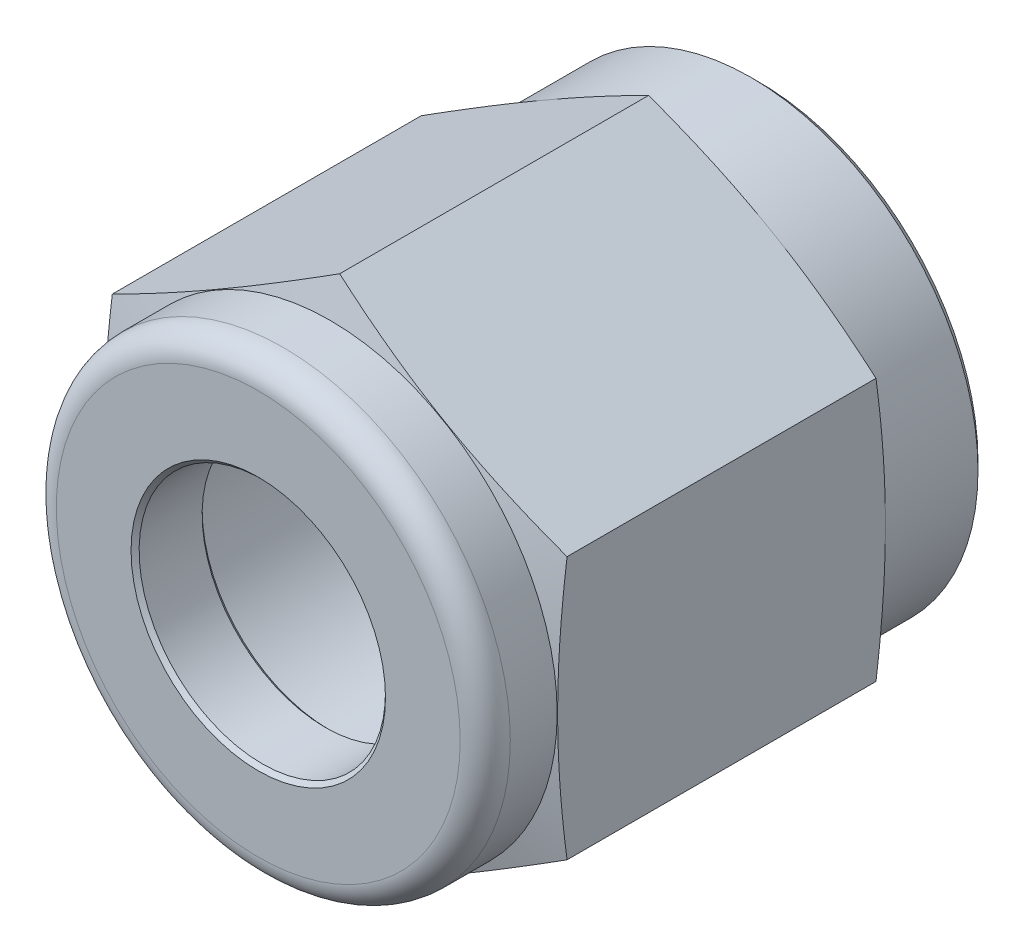
ISO-10303-21;
HEADER;
FILE_DESCRIPTION(('STEP AP214'),'2;1');
FILE_NAME('part.step','',(''),(''),'','','');
FILE_SCHEMA(('AUTOMOTIVE_DESIGN { 1 0 10303 214 1 1 1 1 }'));
ENDSEC;
DATA;
#1=APPLICATION_CONTEXT('core data for automotive mechanical design processes');
#2=APPLICATION_PROTOCOL_DEFINITION('international standard','automotive_design',2000,#1);
#3=PRODUCT_CONTEXT('',#1,'mechanical');
#4=PRODUCT('Part','Part','',(#3));
#5=PRODUCT_RELATED_PRODUCT_CATEGORY('part','',(#4));
#6=PRODUCT_DEFINITION_FORMATION('','',#4);
#7=PRODUCT_DEFINITION_CONTEXT('part definition',#1,'design');
#8=PRODUCT_DEFINITION('design','',#6,#7);
#9=PRODUCT_DEFINITION_SHAPE('','',#8);
#10=(LENGTH_UNIT() NAMED_UNIT(*) SI_UNIT(.MILLI.,.METRE.));
#11=(NAMED_UNIT(*) PLANE_ANGLE_UNIT() SI_UNIT($,.RADIAN.));
#12=(NAMED_UNIT(*) SI_UNIT($,.STERADIAN.) SOLID_ANGLE_UNIT());
#13=UNCERTAINTY_MEASURE_WITH_UNIT(LENGTH_MEASURE(1.E-05),#10,'distance_accuracy_value','');
#14=(GEOMETRIC_REPRESENTATION_CONTEXT(3) GLOBAL_UNCERTAINTY_ASSIGNED_CONTEXT((#13)) GLOBAL_UNIT_ASSIGNED_CONTEXT((#10,
#11,#12)) REPRESENTATION_CONTEXT('',''));
#15=CARTESIAN_POINT('',(0.,0.,0.));
#16=DIRECTION('',(0.,0.,1.));
#17=DIRECTION('',(1.,0.,0.));
#18=AXIS2_PLACEMENT_3D('',#15,#16,#17);
#19=CARTESIAN_POINT('',(0.,8.25622431946549,0.));
#20=DIRECTION('',(0.,0.,1.));
#21=DIRECTION('',(1.,0.,0.));
#22=AXIS2_PLACEMENT_3D('',#19,#20,#21);
#23=PLANE('',#22);
#24=CARTESIAN_POINT('',(0.,0.,0.));
#25=DIRECTION('',(0.,0.,1.));
#26=DIRECTION('',(1.,0.,0.));
#27=AXIS2_PLACEMENT_3D('',#24,#25,#26);
#28=CIRCLE('',#27,6.88339999999999);
#29=CARTESIAN_POINT('',(6.88339999999999,0.,0.));
#30=VERTEX_POINT('',#29);
#31=EDGE_CURVE('E266',#30,#30,#28,.F.);
#32=ORIENTED_EDGE('',*,*,#31,.T.);
#33=EDGE_LOOP('',(#32));
#34=FACE_BOUND('',#33,.T.);
#35=CARTESIAN_POINT('',(0.,0.,0.));
#36=DIRECTION('',(0.,0.,-1.));
#37=DIRECTION('',(0.,1.,0.));
#38=AXIS2_PLACEMENT_3D('',#35,#36,#37);
#39=CIRCLE('',#38,4.78291637771435);
#40=CARTESIAN_POINT('',(0.,4.78291637771435,0.));
#41=VERTEX_POINT('',#40);
#42=EDGE_CURVE('E235',#41,#41,#39,.T.);
#43=ORIENTED_EDGE('',*,*,#42,.F.);
#44=EDGE_LOOP('',(#43));
#45=FACE_BOUND('',#44,.T.);
#46=ADVANCED_FACE('F34',(#34,#45),#23,.F.);
#47=CARTESIAN_POINT('',(0.,0.,0.));
#48=DIRECTION('',(0.,0.,-1.));
#49=DIRECTION('',(0.,1.,0.));
#50=AXIS2_PLACEMENT_3D('',#47,#48,#49);
#51=CYLINDRICAL_SURFACE('',#50,7.1374);
#52=CARTESIAN_POINT('',(0.,0.,0.254000000000007));
#53=DIRECTION('',(0.,0.,1.));
#54=DIRECTION('',(0.,-1.,0.));
#55=AXIS2_PLACEMENT_3D('',#52,#53,#54);
#56=CIRCLE('',#55,7.1374);
#57=CARTESIAN_POINT('',(0.,-7.1374,0.254000000000006));
#58=VERTEX_POINT('',#57);
#59=EDGE_CURVE('E270',#58,#58,#56,.T.);
#60=ORIENTED_EDGE('',*,*,#59,.T.);
#61=EDGE_LOOP('',(#60));
#62=FACE_BOUND('',#61,.T.);
#63=CARTESIAN_POINT('',(0.,0.,3.175));
#64=DIRECTION('',(0.,0.,-1.));
#65=DIRECTION('',(0.,1.,0.));
#66=AXIS2_PLACEMENT_3D('',#63,#64,#65);
#67=CIRCLE('',#66,7.1374);
#68=CARTESIAN_POINT('',(0.,7.1374,3.175));
#69=VERTEX_POINT('',#68);
#70=EDGE_CURVE('E223',#69,#69,#67,.T.);
#71=ORIENTED_EDGE('',*,*,#70,.T.);
#72=EDGE_LOOP('',(#71));
#73=FACE_BOUND('',#72,.T.);
#74=ADVANCED_FACE('F134',(#62,#73),#51,.T.);
#75=CARTESIAN_POINT('',(0.,0.,3.47478807287307));
#76=DIRECTION('',(0.,0.,1.));
#77=DIRECTION('',(0.,-1.,0.));
#78=AXIS2_PLACEMENT_3D('',#75,#76,#77);
#79=CONICAL_SURFACE('',#78,8.25622431946549,1.30899693899575);
#80=ORIENTED_EDGE('',*,*,#70,.F.);
#81=EDGE_LOOP('',(#80));
#82=FACE_BOUND('',#81,.T.);
#83=CARTESIAN_POINT('',(7.1501,-10.9138828398678,4.75860151542387));
#84=CARTESIAN_POINT('',(7.1501,-10.5895769453141,4.68593353797852));
#85=CARTESIAN_POINT('',(7.1501,-10.2650680273871,4.61415538239005));
#86=CARTESIAN_POINT('',(7.1501,-9.61554445132473,4.47285900938083));
#87=CARTESIAN_POINT('',(7.1501,-9.29052977193818,4.40334088976508));
#88=CARTESIAN_POINT('',(7.1501,-8.63960294263009,4.26698420272897));
#89=CARTESIAN_POINT('',(7.1501,-8.31369022433024,4.20014833891397));
#90=CARTESIAN_POINT('',(7.1501,-7.66118595771361,4.06987862293135));
#91=CARTESIAN_POINT('',(7.1501,-7.33459441516394,4.00644474198301));
#92=CARTESIAN_POINT('',(7.1501,-6.68322136510452,3.88427824027479));
#93=CARTESIAN_POINT('',(7.1501,-6.3584461559822,3.82551220270828));
#94=CARTESIAN_POINT('',(7.1501,-5.70800949079891,3.71311782777684));
#95=CARTESIAN_POINT('',(7.1501,-5.38234805443124,3.65948937719041));
#96=CARTESIAN_POINT('',(7.1501,-4.73007647747673,3.55857904077149));
#97=CARTESIAN_POINT('',(7.1501,-4.40346646054479,3.51129636258905));
#98=CARTESIAN_POINT('',(7.1501,-3.74920730598459,3.42447209387384));
#99=CARTESIAN_POINT('',(7.1501,-3.42155816742004,3.38493051031814));
#100=CARTESIAN_POINT('',(7.1501,-2.76152687678763,3.31470950062921));
#101=CARTESIAN_POINT('',(7.1501,-2.42913328445532,3.28413600874202));
#102=CARTESIAN_POINT('',(7.1501,-1.76351186555912,3.23396118681777));
#103=CARTESIAN_POINT('',(7.1501,-1.43028405830245,3.21435960516025));
#104=CARTESIAN_POINT('',(7.1501,-0.763477429194141,3.18727191792475));
#105=CARTESIAN_POINT('',(7.1501,-0.429898834629788,3.17978032997945));
#106=CARTESIAN_POINT('',(7.1501,0.237304404669708,3.17737307413878));
#107=CARTESIAN_POINT('',(7.1501,0.570929049369216,3.1824573965662));
#108=CARTESIAN_POINT('',(7.1501,1.23897011925806,3.20491601919626));
#109=CARTESIAN_POINT('',(7.1501,1.57338501416503,3.22233492739003));
#110=CARTESIAN_POINT('',(7.1501,2.24142747986446,3.26846906294717));
#111=CARTESIAN_POINT('',(7.1501,2.57505503309474,3.29718453993661));
#112=CARTESIAN_POINT('',(7.1501,3.24152020478241,3.36446292134966));
#113=CARTESIAN_POINT('',(7.1501,3.57435716585659,3.40303223824729));
#114=CARTESIAN_POINT('',(7.1501,4.23896018219755,3.48841538968918));
#115=CARTESIAN_POINT('',(7.1501,4.5707262341084,3.53522925004388));
#116=CARTESIAN_POINT('',(7.1501,5.21100647270475,3.63223991881821));
#117=CARTESIAN_POINT('',(7.15009999999999,5.51958762732812,3.68199919010589));
#118=CARTESIAN_POINT('',(7.15009999999999,6.13593768218003,3.78633917810774));
#119=CARTESIAN_POINT('',(7.15009999999999,6.44370656011541,3.840920025763));
#120=CARTESIAN_POINT('',(7.15009999999999,7.05854436625168,3.95402195375594));
#121=CARTESIAN_POINT('',(7.15009999999999,7.36561322948537,4.0125433855596));
#122=CARTESIAN_POINT('',(7.15009999999999,7.97912096047287,4.13280787737556));
#123=CARTESIAN_POINT('',(7.15009999999999,8.28555982003552,4.19455097900331));
#124=CARTESIAN_POINT('',(7.15009999999999,9.20420130280969,4.38373831827979));
#125=CARTESIAN_POINT('',(7.15009999999999,9.8155932174319,4.51511507330491));
#126=CARTESIAN_POINT('',(7.15009999999999,11.0367521079976,4.78497858913828));
#127=CARTESIAN_POINT('',(7.15009999999999,11.6465191763972,4.923464935903));
#128=CARTESIAN_POINT('',(7.15009999999999,12.8589027680631,5.20406216254));
#129=CARTESIAN_POINT('',(7.15009999999999,13.4615306645536,5.3461240373558));
#130=CARTESIAN_POINT('',(7.15009999999999,14.6659456190864,5.63380550214537));
#131=CARTESIAN_POINT('',(7.15009999999999,15.2677326616641,5.77942515666527));
#132=CARTESIAN_POINT('',(7.15009999999999,16.4699234495495,6.07311302859643));
#133=CARTESIAN_POINT('',(7.15009999999999,17.0703279858856,6.22117801444107));
#134=CARTESIAN_POINT('',(7.15009999999999,18.2706138615976,6.51933121206419));
#135=CARTESIAN_POINT('',(7.15009999999999,18.8704952175481,6.66941935707092));
#136=CARTESIAN_POINT('',(7.15009999999999,19.4701941525164,6.82022419671362));
#137=B_SPLINE_CURVE_WITH_KNOTS('',3,(#83,#84,#85,#86,#87,#88,#89,#90,#91,#92,#93,#94,#95,#96,
#97,#98,#99,#100,#101,#102,#103,#104,#105,#106,#107,#108,#109,#110,#111,#112,#113,#114,#115,
#116,#117,#118,#119,#120,#121,#122,#123,#124,#125,#126,#127,#128,#129,#130,#131,#132,#133,#134,
#135,#136),.UNSPECIFIED.,.F.,.F.,(4,2,2,2,2,2,2,2,2,2,2,2,2,2,2,2,2,2,2,2,2,2,2,2,2,2,4),(0.,
0.997046960858289,1.99413701250312,2.9922080643413,3.99027067118493,4.98038490126997,
5.97047730631967,6.96044597056545,7.95041552706989,8.9516470921889,9.95285569497361,
10.9536109092371,11.9543653534154,12.9587576300209,13.9631721024439,14.9682418788671,
15.9733148018248,16.9109716545956,17.8486539794465,18.7864200485021,19.7241982340131,
21.6001685185764,23.4760296753264,25.3334528568964,27.1909097613661,29.0460823073238,
30.9011937748789),.UNSPECIFIED.);
#138=CARTESIAN_POINT('',(7.1501,-4.12811215973275,3.47478807287307));
#139=VERTEX_POINT('',#138);
#140=CARTESIAN_POINT('',(7.1501,4.12811215973275,3.47478807287307));
#141=VERTEX_POINT('',#140);
#142=EDGE_CURVE('E106',#139,#141,#137,.T.);
#143=ORIENTED_EDGE('',*,*,#142,.F.);
#144=CARTESIAN_POINT('',(-0.000199999999988828,-8.25633978951932,3.47481901362982));
#145=CARTESIAN_POINT('',(0.296742266660478,-8.08490009192912,3.42886257681858));
#146=CARTESIAN_POINT('',(0.594222923002725,-7.91314955491122,3.38714171766773));
#147=CARTESIAN_POINT('',(1.19023480972998,-7.56904193166902,3.31384208241379));
#148=CARTESIAN_POINT('',(1.48876641720988,-7.39668462772889,3.2822674258099));
#149=CARTESIAN_POINT('',(2.08507021110049,-7.05240847180735,3.23110350009016));
#150=CARTESIAN_POINT('',(2.38283836532122,-6.88049194781191,3.21145321592267));
#151=CARTESIAN_POINT('',(2.97875440278981,-6.536439663165,3.1851041961545));
#152=CARTESIAN_POINT('',(3.27690220139491,-6.36430395138206,3.17840295474387));
#153=CARTESIAN_POINT('',(3.8731977986051,-6.02003252781616,3.17840295474387));
#154=CARTESIAN_POINT('',(4.17134559721019,-5.84789681603322,3.1851041961545));
#155=CARTESIAN_POINT('',(4.76726163467879,-5.50384453138631,3.21145321592267));
#156=CARTESIAN_POINT('',(5.06502978889951,-5.33192800739088,3.23110350009016));
#157=CARTESIAN_POINT('',(5.66133358279013,-4.98765185146934,3.2822674258099));
#158=CARTESIAN_POINT('',(5.95986519027003,-4.8152945475292,3.31384208241379));
#159=CARTESIAN_POINT('',(6.55587707699728,-4.471186924287,3.38714171766773));
#160=CARTESIAN_POINT('',(6.85335773333953,-4.2994363872691,3.42886257681858));
#161=CARTESIAN_POINT('',(7.1503,-4.1279966896789,3.47481901362982));
#162=B_SPLINE_CURVE_WITH_KNOTS('',3,(#144,#145,#146,#147,#148,#149,#150,#151,#152,#153,#154,
#155,#156,#157,#158,#159,#160,#161),.UNSPECIFIED.,.F.,.F.,(4,2,2,2,2,2,2,2,4),(0.,
1.0378908111893,2.07620248958682,3.10915548710712,4.14190857462195,5.17466166213679,
6.20761465965709,7.24592633805461,8.28381714924391),.UNSPECIFIED.);
#163=CARTESIAN_POINT('',(0.,-8.25622431946549,3.47478807287307));
#164=VERTEX_POINT('',#163);
#165=EDGE_CURVE('E145',#164,#139,#162,.T.);
#166=ORIENTED_EDGE('',*,*,#165,.F.);
#167=CARTESIAN_POINT('',(-7.1503,-4.1279966896789,3.47481901362982));
#168=CARTESIAN_POINT('',(-6.85335773333953,-4.2994363872691,3.42886257681858));
#169=CARTESIAN_POINT('',(-6.55587707699728,-4.471186924287,3.38714171766773));
#170=CARTESIAN_POINT('',(-5.95986519027002,-4.8152945475292,3.31384208241379));
#171=CARTESIAN_POINT('',(-5.66133358279012,-4.98765185146934,3.2822674258099));
#172=CARTESIAN_POINT('',(-5.06502978889951,-5.33192800739088,3.23110350009016));
#173=CARTESIAN_POINT('',(-4.76726163467878,-5.50384453138631,3.21145321592267));
#174=CARTESIAN_POINT('',(-4.17134559721019,-5.84789681603322,3.1851041961545));
#175=CARTESIAN_POINT('',(-3.87319779860509,-6.02003252781616,3.17840295474387));
#176=CARTESIAN_POINT('',(-3.2769022013949,-6.36430395138206,3.17840295474387));
#177=CARTESIAN_POINT('',(-2.9787544027898,-6.536439663165,3.1851041961545));
#178=CARTESIAN_POINT('',(-2.3828383653212,-6.88049194781191,3.21145321592267));
#179=CARTESIAN_POINT('',(-2.08507021110048,-7.05240847180735,3.23110350009016));
#180=CARTESIAN_POINT('',(-1.48876641720987,-7.39668462772889,3.2822674258099));
#181=CARTESIAN_POINT('',(-1.19023480972996,-7.56904193166902,3.31384208241379));
#182=CARTESIAN_POINT('',(-0.594222923002706,-7.91314955491122,3.38714171766773));
#183=CARTESIAN_POINT('',(-0.296742266660458,-8.08490009192912,3.42886257681858));
#184=CARTESIAN_POINT('',(0.000200000000009483,-8.25633978951932,3.47481901362982));
#185=B_SPLINE_CURVE_WITH_KNOTS('',3,(#167,#168,#169,#170,#171,#172,#173,#174,#175,#176,#177,
#178,#179,#180,#181,#182,#183,#184),.UNSPECIFIED.,.F.,.F.,(4,2,2,2,2,2,2,2,4),(0.,
1.0378908111893,2.07620248958683,3.10915548710713,4.14190857462196,5.1746616621368,
6.2076146596571,7.24592633805462,8.28381714924392),.UNSPECIFIED.);
#186=CARTESIAN_POINT('',(-7.15010000000001,-4.12811215973273,3.47478807287307));
#187=VERTEX_POINT('',#186);
#188=EDGE_CURVE('E153',#187,#164,#185,.T.);
#189=ORIENTED_EDGE('',*,*,#188,.F.);
#190=CARTESIAN_POINT('',(-7.15009999999999,-10.9138828398678,4.75860151542387));
#191=CARTESIAN_POINT('',(-7.15009999999999,-10.5895769453141,4.68593353797852));
#192=CARTESIAN_POINT('',(-7.15009999999999,-10.2650680273871,4.61415538239005));
#193=CARTESIAN_POINT('',(-7.15009999999999,-9.61554445132474,4.47285900938083));
#194=CARTESIAN_POINT('',(-7.15009999999999,-9.29052977193818,4.40334088976508));
#195=CARTESIAN_POINT('',(-7.15009999999999,-8.63960294263009,4.26698420272897));
#196=CARTESIAN_POINT('',(-7.15009999999999,-8.31369022433025,4.20014833891397));
#197=CARTESIAN_POINT('',(-7.15009999999999,-7.66118595771361,4.06987862293135));
#198=CARTESIAN_POINT('',(-7.15009999999999,-7.33459441516395,4.00644474198301));
#199=CARTESIAN_POINT('',(-7.15009999999999,-6.68322136510452,3.88427824027479));
#200=CARTESIAN_POINT('',(-7.15009999999999,-6.3584461559822,3.82551220270828));
#201=CARTESIAN_POINT('',(-7.15009999999999,-5.70800949079891,3.71311782777684));
#202=CARTESIAN_POINT('',(-7.15009999999999,-5.38234805443124,3.65948937719041));
#203=CARTESIAN_POINT('',(-7.15009999999999,-4.73007647747673,3.55857904077149));
#204=CARTESIAN_POINT('',(-7.1501,-4.40346646054479,3.51129636258905));
#205=CARTESIAN_POINT('',(-7.1501,-3.7492073059846,3.42447209387384));
#206=CARTESIAN_POINT('',(-7.1501,-3.42155816742005,3.38493051031814));
#207=CARTESIAN_POINT('',(-7.1501,-2.76152687678764,3.31470950062921));
#208=CARTESIAN_POINT('',(-7.1501,-2.42913328445533,3.28413600874202));
#209=CARTESIAN_POINT('',(-7.1501,-1.76351186555912,3.23396118681777));
#210=CARTESIAN_POINT('',(-7.1501,-1.43028405830246,3.21435960516025));
#211=CARTESIAN_POINT('',(-7.1501,-0.763477429194147,3.18727191792475));
#212=CARTESIAN_POINT('',(-7.1501,-0.429898834629794,3.17978032997945));
#213=CARTESIAN_POINT('',(-7.1501,0.237304404669702,3.17737307413878));
#214=CARTESIAN_POINT('',(-7.1501,0.57092904936921,3.1824573965662));
#215=CARTESIAN_POINT('',(-7.1501,1.23897011925806,3.20491601919626));
#216=CARTESIAN_POINT('',(-7.1501,1.57338501416502,3.22233492739003));
#217=CARTESIAN_POINT('',(-7.1501,2.24142747986446,3.26846906294717));
#218=CARTESIAN_POINT('',(-7.1501,2.57505503309474,3.29718453993661));
#219=CARTESIAN_POINT('',(-7.1501,3.2415202047824,3.36446292134967));
#220=CARTESIAN_POINT('',(-7.1501,3.57435716585659,3.40303223824729));
#221=CARTESIAN_POINT('',(-7.1501,4.23896018219754,3.48841538968918));
#222=CARTESIAN_POINT('',(-7.1501,4.5707262341084,3.53522925004388));
#223=CARTESIAN_POINT('',(-7.1501,5.21100647270474,3.63223991881821));
#224=CARTESIAN_POINT('',(-7.1501,5.51958762732811,3.68199919010589));
#225=CARTESIAN_POINT('',(-7.1501,6.13593768218002,3.78633917810774));
#226=CARTESIAN_POINT('',(-7.15010000000001,6.4437065601154,3.840920025763));
#227=CARTESIAN_POINT('',(-7.15010000000001,7.05854436625167,3.95402195375594));
#228=CARTESIAN_POINT('',(-7.15010000000001,7.36561322948536,4.0125433855596));
#229=CARTESIAN_POINT('',(-7.15010000000001,7.97912096047286,4.13280787737556));
#230=CARTESIAN_POINT('',(-7.15010000000001,8.28555982003552,4.19455097900331));
#231=CARTESIAN_POINT('',(-7.15010000000001,9.20420130280969,4.38373831827979));
#232=CARTESIAN_POINT('',(-7.15010000000001,9.81559321743189,4.51511507330491));
#233=CARTESIAN_POINT('',(-7.15010000000001,11.0367521079976,4.78497858913828));
#234=CARTESIAN_POINT('',(-7.15010000000001,11.6465191763972,4.923464935903));
#235=CARTESIAN_POINT('',(-7.15010000000001,12.8589027680631,5.20406216254));
#236=CARTESIAN_POINT('',(-7.15010000000001,13.4615306645536,5.3461240373558));
#237=CARTESIAN_POINT('',(-7.15010000000001,14.6659456190864,5.63380550214537));
#238=CARTESIAN_POINT('',(-7.15010000000001,15.267732661664,5.77942515666527));
#239=CARTESIAN_POINT('',(-7.15010000000001,16.4699234495495,6.07311302859643));
#240=CARTESIAN_POINT('',(-7.15010000000001,17.0703279858856,6.22117801444107));
#241=CARTESIAN_POINT('',(-7.15010000000002,18.2706138615976,6.51933121206419));
#242=CARTESIAN_POINT('',(-7.15010000000002,18.8704952175481,6.66941935707092));
#243=CARTESIAN_POINT('',(-7.15010000000002,19.4701941525164,6.82022419671361));
#244=B_SPLINE_CURVE_WITH_KNOTS('',3,(#190,#191,#192,#193,#194,#195,#196,#197,#198,#199,#200,
#201,#202,#203,#204,#205,#206,#207,#208,#209,#210,#211,#212,#213,#214,#215,#216,#217,#218,#219,
#220,#221,#222,#223,#224,#225,#226,#227,#228,#229,#230,#231,#232,#233,#234,#235,#236,#237,#238,
#239,#240,#241,#242,#243),.UNSPECIFIED.,.F.,.F.,(4,2,2,2,2,2,2,2,2,2,2,2,2,2,2,2,2,2,2,2,2,2,2,
2,2,2,4),(0.,0.997046960858289,1.99413701250312,2.9922080643413,3.99027067118493,
4.98038490126997,5.97047730631967,6.96044597056545,7.95041552706989,8.9516470921889,
9.95285569497361,10.9536109092371,11.9543653534154,12.9587576300209,13.9631721024439,
14.9682418788671,15.9733148018248,16.9109716545956,17.8486539794465,18.7864200485021,
19.7241982340131,21.6001685185764,23.4760296753264,25.3334528568964,27.1909097613661,
29.0460823073238,30.9011937748789),.UNSPECIFIED.);
#245=CARTESIAN_POINT('',(-7.1501,4.12811215973274,3.47478807287307));
#246=VERTEX_POINT('',#245);
#247=EDGE_CURVE('E88',#246,#187,#244,.F.);
#248=ORIENTED_EDGE('',*,*,#247,.F.);
#249=CARTESIAN_POINT('',(0.000200000000000074,8.25633978951933,3.47481901362982));
#250=CARTESIAN_POINT('',(-0.296742266660467,8.08490009192913,3.42886257681859));
#251=CARTESIAN_POINT('',(-0.594222923002715,7.91314955491122,3.38714171766774));
#252=CARTESIAN_POINT('',(-1.19023480972997,7.56904193166902,3.31384208241379));
#253=CARTESIAN_POINT('',(-1.48876641720987,7.39668462772889,3.2822674258099));
#254=CARTESIAN_POINT('',(-2.08507021110049,7.05240847180735,3.23110350009017));
#255=CARTESIAN_POINT('',(-2.38283836532121,6.88049194781192,3.21145321592267));
#256=CARTESIAN_POINT('',(-2.97875440278981,6.53643966316501,3.1851041961545));
#257=CARTESIAN_POINT('',(-3.2769022013949,6.36430395138206,3.17840295474388));
#258=CARTESIAN_POINT('',(-3.8731977986051,6.02003252781617,3.17840295474388));
#259=CARTESIAN_POINT('',(-4.17134559721019,5.84789681603322,3.1851041961545));
#260=CARTESIAN_POINT('',(-4.76726163467879,5.50384453138631,3.21145321592267));
#261=CARTESIAN_POINT('',(-5.06502978889952,5.33192800739088,3.23110350009017));
#262=CARTESIAN_POINT('',(-5.66133358279013,4.98765185146934,3.2822674258099));
#263=CARTESIAN_POINT('',(-5.95986519027003,4.81529454752921,3.31384208241379));
#264=CARTESIAN_POINT('',(-6.55587707699729,4.47118692428701,3.38714171766774));
#265=CARTESIAN_POINT('',(-6.85335773333953,4.2994363872691,3.42886257681859));
#266=CARTESIAN_POINT('',(-7.1503,4.12799668967891,3.47481901362982));
#267=B_SPLINE_CURVE_WITH_KNOTS('',3,(#249,#250,#251,#252,#253,#254,#255,#256,#257,#258,#259,
#260,#261,#262,#263,#264,#265,#266),.UNSPECIFIED.,.F.,.F.,(4,2,2,2,2,2,2,2,4),(0.,
1.0378908111893,2.07620248958682,3.10915548710713,4.14190857462196,5.1746616621368,
6.2076146596571,7.24592633805462,8.28381714924392),.UNSPECIFIED.);
#268=CARTESIAN_POINT('',(0.,8.25622431946549,3.47478807287307));
#269=VERTEX_POINT('',#268);
#270=EDGE_CURVE('E85',#269,#246,#267,.T.);
#271=ORIENTED_EDGE('',*,*,#270,.F.);
#272=CARTESIAN_POINT('',(7.1503,4.12799668967892,3.47481901362982));
#273=CARTESIAN_POINT('',(6.85335773333953,4.29943638726911,3.42886257681859));
#274=CARTESIAN_POINT('',(6.55587707699728,4.47118692428702,3.38714171766774));
#275=CARTESIAN_POINT('',(5.95986519027002,4.81529454752921,3.31384208241379));
#276=CARTESIAN_POINT('',(5.66133358279012,4.98765185146935,3.2822674258099));
#277=CARTESIAN_POINT('',(5.06502978889951,5.33192800739089,3.23110350009017));
#278=CARTESIAN_POINT('',(4.76726163467879,5.50384453138632,3.21145321592267));
#279=CARTESIAN_POINT('',(4.17134559721019,5.84789681603323,3.1851041961545));
#280=CARTESIAN_POINT('',(3.87319779860509,6.02003252781618,3.17840295474388));
#281=CARTESIAN_POINT('',(3.2769022013949,6.36430395138207,3.17840295474388));
#282=CARTESIAN_POINT('',(2.97875440278981,6.53643966316501,3.1851041961545));
#283=CARTESIAN_POINT('',(2.38283836532121,6.88049194781192,3.21145321592267));
#284=CARTESIAN_POINT('',(2.08507021110049,7.05240847180736,3.23110350009017));
#285=CARTESIAN_POINT('',(1.48876641720987,7.39668462772889,3.2822674258099));
#286=CARTESIAN_POINT('',(1.19023480972997,7.56904193166903,3.31384208241379));
#287=CARTESIAN_POINT('',(0.594222923002716,7.91314955491122,3.38714171766774));
#288=CARTESIAN_POINT('',(0.296742266660468,8.08490009192913,3.42886257681859));
#289=CARTESIAN_POINT('',(-0.000199999999998477,8.25633978951933,3.47481901362982));
#290=B_SPLINE_CURVE_WITH_KNOTS('',3,(#272,#273,#274,#275,#276,#277,#278,#279,#280,#281,#282,
#283,#284,#285,#286,#287,#288,#289),.UNSPECIFIED.,.F.,.F.,(4,2,2,2,2,2,2,2,4),(0.,
1.0378908111893,2.07620248958682,3.10915548710712,4.14190857462196,5.17466166213679,
6.20761465965709,7.24592633805461,8.28381714924391),.UNSPECIFIED.);
#291=EDGE_CURVE('E57',#141,#269,#290,.T.);
#292=ORIENTED_EDGE('',*,*,#291,.F.);
#293=EDGE_LOOP('',(#143,#166,#189,#248,#271,#292));
#294=FACE_BOUND('',#293,.T.);
#295=ADVANCED_FACE('F86',(#82,#294),#79,.T.);
#296=CARTESIAN_POINT('',(7.1501,4.12811215973275,15.748));
#297=DIRECTION('',(-0.499999999999999,-0.866025403784439,0.));
#298=DIRECTION('',(0.866025403784439,-0.499999999999999,0.));
#299=AXIS2_PLACEMENT_3D('',#296,#297,#298);
#300=PLANE('',#299);
#301=DIRECTION('',(0.,0.,-1.));
#302=VECTOR('',#301,1.);
#303=CARTESIAN_POINT('',(0.,8.25622431946549,15.748));
#304=LINE('',#303,#302);
#305=CARTESIAN_POINT('',(0.,8.25622431946549,13.1876119271269));
#306=VERTEX_POINT('',#305);
#307=EDGE_CURVE('E99',#306,#269,#304,.T.);
#308=ORIENTED_EDGE('',*,*,#307,.F.);
#309=CARTESIAN_POINT('',(-0.0002,8.25633978951933,13.1875809863702));
#310=CARTESIAN_POINT('',(0.296742266660467,8.08490009192913,13.2335374231814));
#311=CARTESIAN_POINT('',(0.594222923002715,7.91314955491123,13.2752582823323));
#312=CARTESIAN_POINT('',(1.19023480972997,7.56904193166903,13.3485579175862));
#313=CARTESIAN_POINT('',(1.48876641720987,7.39668462772889,13.3801325741901));
#314=CARTESIAN_POINT('',(2.08507021110048,7.05240847180735,13.4312964999098));
#315=CARTESIAN_POINT('',(2.38283836532121,6.88049194781192,13.4509467840773));
#316=CARTESIAN_POINT('',(2.97875440278981,6.53643966316501,13.4772958038455));
#317=CARTESIAN_POINT('',(3.2769022013949,6.36430395138207,13.4839970452561));
#318=CARTESIAN_POINT('',(3.87319779860509,6.02003252781618,13.4839970452561));
#319=CARTESIAN_POINT('',(4.17134559721019,5.84789681603323,13.4772958038455));
#320=CARTESIAN_POINT('',(4.76726163467879,5.50384453138632,13.4509467840773));
#321=CARTESIAN_POINT('',(5.06502978889951,5.33192800739089,13.4312964999098));
#322=CARTESIAN_POINT('',(5.66133358279012,4.98765185146935,13.3801325741901));
#323=CARTESIAN_POINT('',(5.95986519027002,4.81529454752921,13.3485579175862));
#324=CARTESIAN_POINT('',(6.55587707699728,4.47118692428702,13.2752582823323));
#325=CARTESIAN_POINT('',(6.85335773333953,4.29943638726911,13.2335374231814));
#326=CARTESIAN_POINT('',(7.1503,4.12799668967892,13.1875809863702));
#327=B_SPLINE_CURVE_WITH_KNOTS('',3,(#309,#310,#311,#312,#313,#314,#315,#316,#317,#318,#319,
#320,#321,#322,#323,#324,#325,#326),.UNSPECIFIED.,.F.,.F.,(4,2,2,2,2,2,2,2,4),(0.,
1.0378908111893,2.07620248958682,3.10915548710712,4.14190857462196,5.17466166213679,
6.20761465965709,7.24592633805462,8.28381714924391),.UNSPECIFIED.);
#328=CARTESIAN_POINT('',(7.1501,4.12811215973275,13.1876119271269));
#329=VERTEX_POINT('',#328);
#330=EDGE_CURVE('E190',#306,#329,#327,.T.);
#331=ORIENTED_EDGE('',*,*,#330,.T.);
#332=DIRECTION('',(0.,0.,-1.));
#333=VECTOR('',#332,1.);
#334=CARTESIAN_POINT('',(7.1501,4.12811215973275,15.748));
#335=LINE('',#334,#333);
#336=EDGE_CURVE('E101',#329,#141,#335,.T.);
#337=ORIENTED_EDGE('',*,*,#336,.T.);
#338=ORIENTED_EDGE('',*,*,#291,.T.);
#339=EDGE_LOOP('',(#308,#331,#337,#338));
#340=FACE_BOUND('',#339,.T.);
#341=ADVANCED_FACE('F97',(#340),#300,.F.);
#342=CARTESIAN_POINT('',(0.,8.25622431946549,15.748));
#343=DIRECTION('',(0.5,-0.866025403784439,0.));
#344=DIRECTION('',(0.866025403784439,0.5,0.));
#345=AXIS2_PLACEMENT_3D('',#342,#343,#344);
#346=PLANE('',#345);
#347=DIRECTION('',(0.,0.,-1.));
#348=VECTOR('',#347,1.);
#349=CARTESIAN_POINT('',(-7.1501,4.12811215973274,15.748));
#350=LINE('',#349,#348);
#351=CARTESIAN_POINT('',(-7.1501,4.12811215973274,13.1876119271269));
#352=VERTEX_POINT('',#351);
#353=EDGE_CURVE('E107',#352,#246,#350,.T.);
#354=ORIENTED_EDGE('',*,*,#353,.F.);
#355=CARTESIAN_POINT('',(-7.1503,4.12799668967891,13.1875809863702));
#356=CARTESIAN_POINT('',(-6.85335773333954,4.2994363872691,13.2335374231814));
#357=CARTESIAN_POINT('',(-6.55587707699729,4.47118692428701,13.2752582823323));
#358=CARTESIAN_POINT('',(-5.95986519027003,4.81529454752921,13.3485579175862));
#359=CARTESIAN_POINT('',(-5.66133358279013,4.98765185146934,13.3801325741901));
#360=CARTESIAN_POINT('',(-5.06502978889952,5.33192800739088,13.4312964999098));
#361=CARTESIAN_POINT('',(-4.76726163467879,5.50384453138631,13.4509467840773));
#362=CARTESIAN_POINT('',(-4.17134559721019,5.84789681603322,13.4772958038455));
#363=CARTESIAN_POINT('',(-3.8731977986051,6.02003252781617,13.4839970452561));
#364=CARTESIAN_POINT('',(-3.27690220139491,6.36430395138206,13.4839970452561));
#365=CARTESIAN_POINT('',(-2.97875440278981,6.53643966316501,13.4772958038455));
#366=CARTESIAN_POINT('',(-2.38283836532121,6.88049194781192,13.4509467840773));
#367=CARTESIAN_POINT('',(-2.08507021110049,7.05240847180735,13.4312964999098));
#368=CARTESIAN_POINT('',(-1.48876641720988,7.39668462772889,13.3801325741901));
#369=CARTESIAN_POINT('',(-1.19023480972997,7.56904193166902,13.3485579175862));
#370=CARTESIAN_POINT('',(-0.594222923002716,7.91314955491122,13.2752582823323));
#371=CARTESIAN_POINT('',(-0.296742266660468,8.08490009192913,13.2335374231814));
#372=CARTESIAN_POINT('',(0.000199999999999177,8.25633978951933,13.1875809863702));
#373=B_SPLINE_CURVE_WITH_KNOTS('',3,(#355,#356,#357,#358,#359,#360,#361,#362,#363,#364,#365,
#366,#367,#368,#369,#370,#371,#372),.UNSPECIFIED.,.F.,.F.,(4,2,2,2,2,2,2,2,4),(0.,
1.0378908111893,2.07620248958682,3.10915548710713,4.14190857462196,5.1746616621368,
6.2076146596571,7.24592633805462,8.28381714924392),.UNSPECIFIED.);
#374=EDGE_CURVE('E105',#352,#306,#373,.T.);
#375=ORIENTED_EDGE('',*,*,#374,.T.);
#376=ORIENTED_EDGE('',*,*,#307,.T.);
#377=ORIENTED_EDGE('',*,*,#270,.T.);
#378=EDGE_LOOP('',(#354,#375,#376,#377));
#379=FACE_BOUND('',#378,.T.);
#380=ADVANCED_FACE('F104',(#379),#346,.F.);
#381=CARTESIAN_POINT('',(-7.1501,4.12811215973274,15.748));
#382=DIRECTION('',(1.,0.,0.));
#383=DIRECTION('',(0.,1.,0.));
#384=AXIS2_PLACEMENT_3D('',#381,#382,#383);
#385=PLANE('',#384);
#386=DIRECTION('',(0.,0.,-1.));
#387=VECTOR('',#386,1.);
#388=CARTESIAN_POINT('',(-7.1501,-4.12811215973274,15.748));
#389=LINE('',#388,#387);
#390=CARTESIAN_POINT('',(-7.15010000000001,-4.12811215973274,13.1876119271269));
#391=VERTEX_POINT('',#390);
#392=EDGE_CURVE('E111',#391,#187,#389,.T.);
#393=ORIENTED_EDGE('',*,*,#392,.F.);
#394=CARTESIAN_POINT('',(-7.15009999999999,-10.9138828398678,11.9037984845761));
#395=CARTESIAN_POINT('',(-7.15009999999999,-10.5895769453141,11.9764664620215));
#396=CARTESIAN_POINT('',(-7.15009999999999,-10.2650680273871,12.0482446176099));
#397=CARTESIAN_POINT('',(-7.15009999999999,-9.61554445132474,12.1895409906192));
#398=CARTESIAN_POINT('',(-7.15009999999999,-9.29052977193818,12.2590591102349));
#399=CARTESIAN_POINT('',(-7.15009999999999,-8.63960294263009,12.395415797271));
#400=CARTESIAN_POINT('',(-7.15009999999999,-8.31369022433025,12.462251661086));
#401=CARTESIAN_POINT('',(-7.15009999999999,-7.66118595771361,12.5925213770686));
#402=CARTESIAN_POINT('',(-7.15009999999999,-7.33459441516395,12.655955258017));
#403=CARTESIAN_POINT('',(-7.15009999999999,-6.68322136510452,12.7781217597252));
#404=CARTESIAN_POINT('',(-7.15009999999999,-6.3584461559822,12.8368877972917));
#405=CARTESIAN_POINT('',(-7.15009999999999,-5.70800949079891,12.9492821722232));
#406=CARTESIAN_POINT('',(-7.15009999999999,-5.38234805443124,13.0029106228096));
#407=CARTESIAN_POINT('',(-7.15009999999999,-4.73007647747673,13.1038209592285));
#408=CARTESIAN_POINT('',(-7.1501,-4.40346646054479,13.1511036374109));
#409=CARTESIAN_POINT('',(-7.1501,-3.7492073059846,13.2379279061262));
#410=CARTESIAN_POINT('',(-7.1501,-3.42155816742005,13.2774694896819));
#411=CARTESIAN_POINT('',(-7.1501,-2.76152687678764,13.3476904993708));
#412=CARTESIAN_POINT('',(-7.1501,-2.42913328445533,13.378263991258));
#413=CARTESIAN_POINT('',(-7.1501,-1.76351186555912,13.4284388131822));
#414=CARTESIAN_POINT('',(-7.1501,-1.43028405830246,13.4480403948397));
#415=CARTESIAN_POINT('',(-7.1501,-0.763477429194146,13.4751280820752));
#416=CARTESIAN_POINT('',(-7.1501,-0.429898834629792,13.4826196700206));
#417=CARTESIAN_POINT('',(-7.1501,0.237304404669703,13.4850269258612));
#418=CARTESIAN_POINT('',(-7.1501,0.570929049369213,13.4799426034338));
#419=CARTESIAN_POINT('',(-7.1501,1.23897011925806,13.4574839808037));
#420=CARTESIAN_POINT('',(-7.1501,1.57338501416502,13.44006507261));
#421=CARTESIAN_POINT('',(-7.1501,2.24142747986446,13.3939309370528));
#422=CARTESIAN_POINT('',(-7.1501,2.57505503309474,13.3652154600634));
#423=CARTESIAN_POINT('',(-7.1501,3.2415202047824,13.2979370786503));
#424=CARTESIAN_POINT('',(-7.1501,3.57435716585659,13.2593677617527));
#425=CARTESIAN_POINT('',(-7.1501,4.23896018219754,13.1739846103108));
#426=CARTESIAN_POINT('',(-7.1501,4.5707262341084,13.1271707499561));
#427=CARTESIAN_POINT('',(-7.1501,5.21100647270475,13.0301600811818));
#428=CARTESIAN_POINT('',(-7.1501,5.51958762732812,12.9804008098941));
#429=CARTESIAN_POINT('',(-7.1501,6.13593768218003,12.8760608218923));
#430=CARTESIAN_POINT('',(-7.15010000000001,6.44370656011541,12.821479974237));
#431=CARTESIAN_POINT('',(-7.15010000000001,7.05854436625168,12.7083780462441));
#432=CARTESIAN_POINT('',(-7.15010000000001,7.36561322948537,12.6498566144404));
#433=CARTESIAN_POINT('',(-7.15010000000001,7.97912096047287,12.5295921226244));
#434=CARTESIAN_POINT('',(-7.15010000000001,8.28555982003552,12.4678490209967));
#435=CARTESIAN_POINT('',(-7.15010000000001,9.20420130280969,12.2786616817202));
#436=CARTESIAN_POINT('',(-7.15010000000001,9.8155932174319,12.1472849266951));
#437=CARTESIAN_POINT('',(-7.15010000000001,11.0367521079976,11.8774214108617));
#438=CARTESIAN_POINT('',(-7.15010000000001,11.6465191763972,11.738935064097));
#439=CARTESIAN_POINT('',(-7.15010000000001,12.8589027680631,11.45833783746));
#440=CARTESIAN_POINT('',(-7.15010000000001,13.4615306645536,11.3162759626442));
#441=CARTESIAN_POINT('',(-7.15010000000001,14.6659456190864,11.0285944978546));
#442=CARTESIAN_POINT('',(-7.15010000000001,15.267732661664,10.8829748433347));
#443=CARTESIAN_POINT('',(-7.15010000000001,16.4699234495495,10.5892869714036));
#444=CARTESIAN_POINT('',(-7.15010000000001,17.0703279858856,10.4412219855589));
#445=CARTESIAN_POINT('',(-7.15010000000002,18.2706138615976,10.1430687879358));
#446=CARTESIAN_POINT('',(-7.15010000000002,18.8704952175481,9.99298064292908));
#447=CARTESIAN_POINT('',(-7.15010000000002,19.4701941525164,9.84217580328638));
#448=B_SPLINE_CURVE_WITH_KNOTS('',3,(#394,#395,#396,#397,#398,#399,#400,#401,#402,#403,#404,
#405,#406,#407,#408,#409,#410,#411,#412,#413,#414,#415,#416,#417,#418,#419,#420,#421,#422,#423,
#424,#425,#426,#427,#428,#429,#430,#431,#432,#433,#434,#435,#436,#437,#438,#439,#440,#441,#442,
#443,#444,#445,#446,#447),.UNSPECIFIED.,.F.,.F.,(4,2,2,2,2,2,2,2,2,2,2,2,2,2,2,2,2,2,2,2,2,2,2,
2,2,2,4),(0.,0.997046960858291,1.99413701250312,2.9922080643413,3.99027067118493,
4.98038490126997,5.97047730631967,6.96044597056546,7.95041552706989,8.9516470921889,
9.95285569497362,10.9536109092371,11.9543653534154,12.9587576300209,13.9631721024439,
14.9682418788671,15.9733148018248,16.9109716545956,17.8486539794465,18.7864200485021,
19.7241982340131,21.6001685185764,23.4760296753264,25.3334528568964,27.1909097613661,
29.0460823073238,30.9011937748789),.UNSPECIFIED.);
#449=EDGE_CURVE('E191',#391,#352,#448,.T.);
#450=ORIENTED_EDGE('',*,*,#449,.T.);
#451=ORIENTED_EDGE('',*,*,#353,.T.);
#452=ORIENTED_EDGE('',*,*,#247,.T.);
#453=EDGE_LOOP('',(#393,#450,#451,#452));
#454=FACE_BOUND('',#453,.T.);
#455=ADVANCED_FACE('F178',(#454),#385,.F.);
#456=CARTESIAN_POINT('',(-7.1501,-4.12811215973274,15.748));
#457=DIRECTION('',(0.5,0.866025403784439,0.));
#458=DIRECTION('',(-0.866025403784439,0.499999999999999,0.));
#459=AXIS2_PLACEMENT_3D('',#456,#457,#458);
#460=PLANE('',#459);
#461=DIRECTION('',(0.,0.,-1.));
#462=VECTOR('',#461,1.);
#463=CARTESIAN_POINT('',(0.,-8.25622431946548,15.748));
#464=LINE('',#463,#462);
#465=CARTESIAN_POINT('',(0.,-8.25622431946549,13.1876119271269));
#466=VERTEX_POINT('',#465);
#467=EDGE_CURVE('E206',#466,#164,#464,.T.);
#468=ORIENTED_EDGE('',*,*,#467,.F.);
#469=CARTESIAN_POINT('',(0.000200000000011247,-8.25633978951932,13.1875809863702));
#470=CARTESIAN_POINT('',(-0.296742266660456,-8.08490009192912,13.2335374231814));
#471=CARTESIAN_POINT('',(-0.594222923002704,-7.91314955491122,13.2752582823323));
#472=CARTESIAN_POINT('',(-1.19023480972996,-7.56904193166902,13.3485579175862));
#473=CARTESIAN_POINT('',(-1.48876641720986,-7.39668462772889,13.3801325741901));
#474=CARTESIAN_POINT('',(-2.08507021110048,-7.05240847180735,13.4312964999098));
#475=CARTESIAN_POINT('',(-2.3828383653212,-6.88049194781191,13.4509467840773));
#476=CARTESIAN_POINT('',(-2.9787544027898,-6.536439663165,13.4772958038455));
#477=CARTESIAN_POINT('',(-3.2769022013949,-6.36430395138206,13.4839970452561));
#478=CARTESIAN_POINT('',(-3.87319779860509,-6.02003252781616,13.4839970452561));
#479=CARTESIAN_POINT('',(-4.17134559721018,-5.84789681603322,13.4772958038455));
#480=CARTESIAN_POINT('',(-4.76726163467878,-5.50384453138631,13.4509467840773));
#481=CARTESIAN_POINT('',(-5.06502978889951,-5.33192800739088,13.4312964999098));
#482=CARTESIAN_POINT('',(-5.66133358279012,-4.98765185146934,13.3801325741901));
#483=CARTESIAN_POINT('',(-5.95986519027002,-4.8152945475292,13.3485579175862));
#484=CARTESIAN_POINT('',(-6.55587707699728,-4.471186924287,13.2752582823323));
#485=CARTESIAN_POINT('',(-6.85335773333953,-4.2994363872691,13.2335374231814));
#486=CARTESIAN_POINT('',(-7.1503,-4.1279966896789,13.1875809863702));
#487=B_SPLINE_CURVE_WITH_KNOTS('',3,(#469,#470,#471,#472,#473,#474,#475,#476,#477,#478,#479,
#480,#481,#482,#483,#484,#485,#486),.UNSPECIFIED.,.F.,.F.,(4,2,2,2,2,2,2,2,4),(0.,
1.0378908111893,2.07620248958683,3.10915548710713,4.14190857462196,5.1746616621368,
6.2076146596571,7.24592633805463,8.28381714924392),.UNSPECIFIED.);
#488=EDGE_CURVE('E215',#466,#391,#487,.T.);
#489=ORIENTED_EDGE('',*,*,#488,.T.);
#490=ORIENTED_EDGE('',*,*,#392,.T.);
#491=ORIENTED_EDGE('',*,*,#188,.T.);
#492=EDGE_LOOP('',(#468,#489,#490,#491));
#493=FACE_BOUND('',#492,.T.);
#494=ADVANCED_FACE('F214',(#493),#460,.F.);
#495=CARTESIAN_POINT('',(0.,-8.25622431946548,15.748));
#496=DIRECTION('',(-0.500000000000001,0.866025403784438,0.));
#497=DIRECTION('',(-0.866025403784438,-0.500000000000001,0.));
#498=AXIS2_PLACEMENT_3D('',#495,#496,#497);
#499=PLANE('',#498);
#500=DIRECTION('',(0.,0.,-1.));
#501=VECTOR('',#500,1.);
#502=CARTESIAN_POINT('',(7.1501,-4.12811215973274,15.748));
#503=LINE('',#502,#501);
#504=CARTESIAN_POINT('',(7.1501,-4.12811215973274,13.1876119271269));
#505=VERTEX_POINT('',#504);
#506=EDGE_CURVE('E203',#505,#139,#503,.T.);
#507=ORIENTED_EDGE('',*,*,#506,.F.);
#508=CARTESIAN_POINT('',(7.1503,-4.1279966896789,13.1875809863702));
#509=CARTESIAN_POINT('',(6.85335773333953,-4.2994363872691,13.2335374231814));
#510=CARTESIAN_POINT('',(6.55587707699729,-4.471186924287,13.2752582823323));
#511=CARTESIAN_POINT('',(5.95986519027003,-4.8152945475292,13.3485579175862));
#512=CARTESIAN_POINT('',(5.66133358279013,-4.98765185146933,13.3801325741901));
#513=CARTESIAN_POINT('',(5.06502978889952,-5.33192800739087,13.4312964999098));
#514=CARTESIAN_POINT('',(4.76726163467879,-5.50384453138631,13.4509467840773));
#515=CARTESIAN_POINT('',(4.1713455972102,-5.84789681603322,13.4772958038455));
#516=CARTESIAN_POINT('',(3.8731977986051,-6.02003252781616,13.4839970452561));
#517=CARTESIAN_POINT('',(3.27690220139491,-6.36430395138206,13.4839970452561));
#518=CARTESIAN_POINT('',(2.97875440278981,-6.536439663165,13.4772958038455));
#519=CARTESIAN_POINT('',(2.38283836532122,-6.88049194781191,13.4509467840773));
#520=CARTESIAN_POINT('',(2.08507021110049,-7.05240847180735,13.4312964999098));
#521=CARTESIAN_POINT('',(1.48876641720988,-7.39668462772889,13.3801325741901));
#522=CARTESIAN_POINT('',(1.19023480972998,-7.56904193166902,13.3485579175862));
#523=CARTESIAN_POINT('',(0.594222923002724,-7.91314955491122,13.2752582823323));
#524=CARTESIAN_POINT('',(0.296742266660477,-8.08490009192912,13.2335374231814));
#525=CARTESIAN_POINT('',(-0.000199999999989722,-8.25633978951932,13.1875809863702));
#526=B_SPLINE_CURVE_WITH_KNOTS('',3,(#508,#509,#510,#511,#512,#513,#514,#515,#516,#517,#518,
#519,#520,#521,#522,#523,#524,#525),.UNSPECIFIED.,.F.,.F.,(4,2,2,2,2,2,2,2,4),(0.,
1.0378908111893,2.07620248958682,3.10915548710712,4.14190857462196,5.17466166213679,
6.20761465965709,7.24592633805461,8.28381714924391),.UNSPECIFIED.);
#527=EDGE_CURVE('E49',#505,#466,#526,.T.);
#528=ORIENTED_EDGE('',*,*,#527,.T.);
#529=ORIENTED_EDGE('',*,*,#467,.T.);
#530=ORIENTED_EDGE('',*,*,#165,.T.);
#531=EDGE_LOOP('',(#507,#528,#529,#530));
#532=FACE_BOUND('',#531,.T.);
#533=ADVANCED_FACE('F383',(#532),#499,.F.);
#534=CARTESIAN_POINT('',(7.1501,-4.12811215973274,15.748));
#535=DIRECTION('',(-1.,0.,0.));
#536=DIRECTION('',(0.,-1.,0.));
#537=AXIS2_PLACEMENT_3D('',#534,#535,#536);
#538=PLANE('',#537);
#539=ORIENTED_EDGE('',*,*,#336,.F.);
#540=CARTESIAN_POINT('',(7.1501,-10.9138828398678,11.9037984845761));
#541=CARTESIAN_POINT('',(7.1501,-10.5895769453141,11.9764664620215));
#542=CARTESIAN_POINT('',(7.1501,-10.2650680273871,12.0482446176099));
#543=CARTESIAN_POINT('',(7.1501,-9.61554445132473,12.1895409906192));
#544=CARTESIAN_POINT('',(7.1501,-9.29052977193818,12.2590591102349));
#545=CARTESIAN_POINT('',(7.1501,-8.63960294263009,12.395415797271));
#546=CARTESIAN_POINT('',(7.1501,-8.31369022433024,12.462251661086));
#547=CARTESIAN_POINT('',(7.1501,-7.66118595771361,12.5925213770686));
#548=CARTESIAN_POINT('',(7.1501,-7.33459441516394,12.655955258017));
#549=CARTESIAN_POINT('',(7.1501,-6.68322136510452,12.7781217597252));
#550=CARTESIAN_POINT('',(7.1501,-6.3584461559822,12.8368877972917));
#551=CARTESIAN_POINT('',(7.1501,-5.70800949079891,12.9492821722232));
#552=CARTESIAN_POINT('',(7.1501,-5.38234805443124,13.0029106228096));
#553=CARTESIAN_POINT('',(7.1501,-4.73007647747673,13.1038209592285));
#554=CARTESIAN_POINT('',(7.1501,-4.40346646054479,13.1511036374109));
#555=CARTESIAN_POINT('',(7.1501,-3.74920730598459,13.2379279061262));
#556=CARTESIAN_POINT('',(7.1501,-3.42155816742004,13.2774694896819));
#557=CARTESIAN_POINT('',(7.1501,-2.76152687678763,13.3476904993708));
#558=CARTESIAN_POINT('',(7.1501,-2.42913328445533,13.378263991258));
#559=CARTESIAN_POINT('',(7.1501,-1.76351186555912,13.4284388131822));
#560=CARTESIAN_POINT('',(7.1501,-1.43028405830245,13.4480403948397));
#561=CARTESIAN_POINT('',(7.1501,-0.763477429194143,13.4751280820752));
#562=CARTESIAN_POINT('',(7.1501,-0.429898834629789,13.4826196700206));
#563=CARTESIAN_POINT('',(7.1501,0.237304404669707,13.4850269258612));
#564=CARTESIAN_POINT('',(7.1501,0.570929049369215,13.4799426034338));
#565=CARTESIAN_POINT('',(7.1501,1.23897011925806,13.4574839808037));
#566=CARTESIAN_POINT('',(7.1501,1.57338501416503,13.44006507261));
#567=CARTESIAN_POINT('',(7.1501,2.24142747986447,13.3939309370528));
#568=CARTESIAN_POINT('',(7.1501,2.57505503309474,13.3652154600634));
#569=CARTESIAN_POINT('',(7.1501,3.24152020478241,13.2979370786503));
#570=CARTESIAN_POINT('',(7.1501,3.57435716585659,13.2593677617527));
#571=CARTESIAN_POINT('',(7.1501,4.23896018219755,13.1739846103108));
#572=CARTESIAN_POINT('',(7.1501,4.57072623410841,13.1271707499561));
#573=CARTESIAN_POINT('',(7.1501,5.21100647270475,13.0301600811818));
#574=CARTESIAN_POINT('',(7.15009999999999,5.51958762732812,12.9804008098941));
#575=CARTESIAN_POINT('',(7.15009999999999,6.13593768218003,12.8760608218923));
#576=CARTESIAN_POINT('',(7.15009999999999,6.44370656011541,12.821479974237));
#577=CARTESIAN_POINT('',(7.15009999999999,7.05854436625168,12.7083780462441));
#578=CARTESIAN_POINT('',(7.15009999999999,7.36561322948538,12.6498566144404));
#579=CARTESIAN_POINT('',(7.15009999999999,7.97912096047288,12.5295921226244));
#580=CARTESIAN_POINT('',(7.15009999999999,8.28555982003553,12.4678490209967));
#581=CARTESIAN_POINT('',(7.15009999999999,9.2042013028097,12.2786616817202));
#582=CARTESIAN_POINT('',(7.15009999999999,9.81559321743191,12.1472849266951));
#583=CARTESIAN_POINT('',(7.15009999999999,11.0367521079976,11.8774214108617));
#584=CARTESIAN_POINT('',(7.15009999999999,11.6465191763972,11.738935064097));
#585=CARTESIAN_POINT('',(7.15009999999999,12.8589027680631,11.45833783746));
#586=CARTESIAN_POINT('',(7.15009999999999,13.4615306645536,11.3162759626442));
#587=CARTESIAN_POINT('',(7.15009999999999,14.6659456190864,11.0285944978546));
#588=CARTESIAN_POINT('',(7.15009999999999,15.2677326616641,10.8829748433347));
#589=CARTESIAN_POINT('',(7.15009999999999,16.4699234495495,10.5892869714036));
#590=CARTESIAN_POINT('',(7.15009999999999,17.0703279858856,10.4412219855589));
#591=CARTESIAN_POINT('',(7.15009999999999,18.2706138615976,10.1430687879358));
#592=CARTESIAN_POINT('',(7.15009999999999,18.8704952175481,9.99298064292907));
#593=CARTESIAN_POINT('',(7.15009999999999,19.4701941525164,9.84217580328638));
#594=B_SPLINE_CURVE_WITH_KNOTS('',3,(#540,#541,#542,#543,#544,#545,#546,#547,#548,#549,#550,
#551,#552,#553,#554,#555,#556,#557,#558,#559,#560,#561,#562,#563,#564,#565,#566,#567,#568,#569,
#570,#571,#572,#573,#574,#575,#576,#577,#578,#579,#580,#581,#582,#583,#584,#585,#586,#587,#588,
#589,#590,#591,#592,#593),.UNSPECIFIED.,.F.,.F.,(4,2,2,2,2,2,2,2,2,2,2,2,2,2,2,2,2,2,2,2,2,2,2,
2,2,2,4),(0.,0.997046960858291,1.99413701250312,2.9922080643413,3.99027067118493,
4.98038490126997,5.97047730631967,6.96044597056545,7.95041552706989,8.9516470921889,
9.95285569497361,10.9536109092371,11.9543653534154,12.9587576300209,13.9631721024439,
14.9682418788671,15.9733148018248,16.9109716545956,17.8486539794465,18.7864200485021,
19.7241982340131,21.6001685185764,23.4760296753264,25.3334528568964,27.1909097613661,
29.0460823073238,30.9011937748789),.UNSPECIFIED.);
#595=EDGE_CURVE('E109',#329,#505,#594,.F.);
#596=ORIENTED_EDGE('',*,*,#595,.T.);
#597=ORIENTED_EDGE('',*,*,#506,.T.);
#598=ORIENTED_EDGE('',*,*,#142,.T.);
#599=EDGE_LOOP('',(#539,#596,#597,#598));
#600=FACE_BOUND('',#599,.T.);
#601=ADVANCED_FACE('F127',(#600),#538,.F.);
#602=CARTESIAN_POINT('',(0.,0.,13.4874));
#603=DIRECTION('',(0.,0.,-1.));
#604=DIRECTION('',(0.,1.,0.));
#605=AXIS2_PLACEMENT_3D('',#602,#603,#604);
#606=CONICAL_SURFACE('',#605,7.1374,1.30899693899575);
#607=CARTESIAN_POINT('',(0.,0.,13.4874));
#608=DIRECTION('',(0.,0.,-1.));
#609=DIRECTION('',(0.,1.,0.));
#610=AXIS2_PLACEMENT_3D('',#607,#608,#609);
#611=CIRCLE('',#610,7.1374);
#612=CARTESIAN_POINT('',(0.,7.1374,13.4874));
#613=VERTEX_POINT('',#612);
#614=EDGE_CURVE('E219',#613,#613,#611,.T.);
#615=ORIENTED_EDGE('',*,*,#614,.T.);
#616=EDGE_LOOP('',(#615));
#617=FACE_BOUND('',#616,.T.);
#618=ORIENTED_EDGE('',*,*,#374,.F.);
#619=ORIENTED_EDGE('',*,*,#449,.F.);
#620=ORIENTED_EDGE('',*,*,#488,.F.);
#621=ORIENTED_EDGE('',*,*,#527,.F.);
#622=ORIENTED_EDGE('',*,*,#595,.F.);
#623=ORIENTED_EDGE('',*,*,#330,.F.);
#624=EDGE_LOOP('',(#618,#619,#620,#621,#622,#623));
#625=FACE_BOUND('',#624,.T.);
#626=ADVANCED_FACE('F137',(#617,#625),#606,.T.);
#627=CARTESIAN_POINT('',(0.,0.,0.));
#628=DIRECTION('',(0.,0.,-1.));
#629=DIRECTION('',(0.,1.,0.));
#630=AXIS2_PLACEMENT_3D('',#627,#628,#629);
#631=CYLINDRICAL_SURFACE('',#630,7.1374);
#632=CARTESIAN_POINT('',(0.,0.,14.9606));
#633=DIRECTION('',(0.,0.,1.));
#634=DIRECTION('',(1.,0.,0.));
#635=AXIS2_PLACEMENT_3D('',#632,#633,#634);
#636=CIRCLE('',#635,7.1374);
#637=CARTESIAN_POINT('',(7.1374,0.,14.9606));
#638=VERTEX_POINT('',#637);
#639=EDGE_CURVE('E262',#638,#638,#636,.F.);
#640=ORIENTED_EDGE('',*,*,#639,.T.);
#641=EDGE_LOOP('',(#640));
#642=FACE_BOUND('',#641,.T.);
#643=ORIENTED_EDGE('',*,*,#614,.F.);
#644=EDGE_LOOP('',(#643));
#645=FACE_BOUND('',#644,.T.);
#646=ADVANCED_FACE('F252',(#642,#645),#631,.T.);
#647=CARTESIAN_POINT('',(0.,8.25622431946549,15.748));
#648=DIRECTION('',(0.,0.,1.));
#649=DIRECTION('',(1.,0.,0.));
#650=AXIS2_PLACEMENT_3D('',#647,#648,#649);
#651=PLANE('',#650);
#652=CARTESIAN_POINT('',(0.,0.,15.748));
#653=DIRECTION('',(0.,0.,1.));
#654=DIRECTION('',(1.,0.,0.));
#655=AXIS2_PLACEMENT_3D('',#652,#653,#654);
#656=CIRCLE('',#655,4.0005);
#657=CARTESIAN_POINT('',(4.0005,0.,15.748));
#658=VERTEX_POINT('',#657);
#659=EDGE_CURVE('E11',#658,#658,#656,.F.);
#660=ORIENTED_EDGE('',*,*,#659,.T.);
#661=EDGE_LOOP('',(#660));
#662=FACE_BOUND('',#661,.T.);
#663=CARTESIAN_POINT('',(0.,0.,15.748));
#664=DIRECTION('',(0.,0.,1.));
#665=DIRECTION('',(1.,0.,0.));
#666=AXIS2_PLACEMENT_3D('',#663,#664,#665);
#667=CIRCLE('',#666,6.35);
#668=CARTESIAN_POINT('',(6.35,0.,15.748));
#669=VERTEX_POINT('',#668);
#670=EDGE_CURVE('E264',#669,#669,#667,.T.);
#671=ORIENTED_EDGE('',*,*,#670,.T.);
#672=EDGE_LOOP('',(#671));
#673=FACE_BOUND('',#672,.T.);
#674=ADVANCED_FACE('F249',(#662,#673),#651,.T.);
#675=CARTESIAN_POINT('',(0.,0.,0.));
#676=DIRECTION('',(0.,0.,-1.));
#677=DIRECTION('',(0.,1.,0.));
#678=AXIS2_PLACEMENT_3D('',#675,#676,#677);
#679=CYLINDRICAL_SURFACE('',#678,3.8735);
#680=CARTESIAN_POINT('',(0.,0.,13.6398));
#681=DIRECTION('',(0.,0.,1.));
#682=DIRECTION('',(0.,-1.,0.));
#683=AXIS2_PLACEMENT_3D('',#680,#681,#682);
#684=CIRCLE('',#683,3.8735);
#685=CARTESIAN_POINT('',(0.,-3.8735,13.6398));
#686=VERTEX_POINT('',#685);
#687=EDGE_CURVE('E276',#686,#686,#684,.F.);
#688=ORIENTED_EDGE('',*,*,#687,.T.);
#689=EDGE_LOOP('',(#688));
#690=FACE_BOUND('',#689,.T.);
#691=CARTESIAN_POINT('',(0.,0.,15.621));
#692=DIRECTION('',(0.,0.,1.));
#693=DIRECTION('',(0.,-1.,0.));
#694=AXIS2_PLACEMENT_3D('',#691,#692,#693);
#695=CIRCLE('',#694,3.8735);
#696=CARTESIAN_POINT('',(0.,-3.8735,15.621));
#697=VERTEX_POINT('',#696);
#698=EDGE_CURVE('E273',#697,#697,#695,.T.);
#699=ORIENTED_EDGE('',*,*,#698,.T.);
#700=EDGE_LOOP('',(#699));
#701=FACE_BOUND('',#700,.T.);
#702=ADVANCED_FACE('F251',(#690,#701),#679,.F.);
#703=CARTESIAN_POINT('',(0.,3.8735,13.5128));
#704=DIRECTION('',(0.,0.,1.));
#705=DIRECTION('',(0.,-1.,0.));
#706=AXIS2_PLACEMENT_3D('',#703,#704,#705);
#707=PLANE('',#706);
#708=CARTESIAN_POINT('',(0.,0.,13.5128));
#709=DIRECTION('',(0.,0.,1.));
#710=DIRECTION('',(0.,-1.,0.));
#711=AXIS2_PLACEMENT_3D('',#708,#709,#710);
#712=CIRCLE('',#711,4.0005);
#713=CARTESIAN_POINT('',(0.,-4.0005,13.5128));
#714=VERTEX_POINT('',#713);
#715=EDGE_CURVE('E42',#714,#714,#712,.T.);
#716=ORIENTED_EDGE('',*,*,#715,.T.);
#717=EDGE_LOOP('',(#716));
#718=FACE_BOUND('',#717,.T.);
#719=CARTESIAN_POINT('',(0.,0.,13.5128));
#720=DIRECTION('',(0.,0.,-1.));
#721=DIRECTION('',(0.,1.,0.));
#722=AXIS2_PLACEMENT_3D('',#719,#720,#721);
#723=CIRCLE('',#722,4.52891637771436);
#724=CARTESIAN_POINT('',(0.,4.52891637771435,13.5128));
#725=VERTEX_POINT('',#724);
#726=EDGE_CURVE('E227',#725,#725,#723,.T.);
#727=ORIENTED_EDGE('',*,*,#726,.T.);
#728=EDGE_LOOP('',(#727));
#729=FACE_BOUND('',#728,.T.);
#730=ADVANCED_FACE('F281',(#718,#729),#707,.F.);
#731=CARTESIAN_POINT('',(0.,0.,13.2588));
#732=DIRECTION('',(0.,0.,-1.));
#733=DIRECTION('',(0.,1.,0.));
#734=AXIS2_PLACEMENT_3D('',#731,#732,#733);
#735=TOROIDAL_SURFACE('',#734,4.52891637771436,0.254000000000001);
#736=ORIENTED_EDGE('',*,*,#726,.F.);
#737=EDGE_LOOP('',(#736));
#738=FACE_BOUND('',#737,.T.);
#739=CARTESIAN_POINT('',(0.,0.,13.2588));
#740=DIRECTION('',(0.,0.,-1.));
#741=DIRECTION('',(0.,1.,0.));
#742=AXIS2_PLACEMENT_3D('',#739,#740,#741);
#743=CIRCLE('',#742,4.78291637771436);
#744=CARTESIAN_POINT('',(0.,4.78291637771435,13.2588));
#745=VERTEX_POINT('',#744);
#746=EDGE_CURVE('E232',#745,#745,#743,.T.);
#747=ORIENTED_EDGE('',*,*,#746,.T.);
#748=EDGE_LOOP('',(#747));
#749=FACE_BOUND('',#748,.T.);
#750=ADVANCED_FACE('F308',(#738,#749),#735,.F.);
#751=CARTESIAN_POINT('',(0.,0.,0.));
#752=DIRECTION('',(0.,0.,-1.));
#753=DIRECTION('',(0.,1.,0.));
#754=AXIS2_PLACEMENT_3D('',#751,#752,#753);
#755=CYLINDRICAL_SURFACE('',#754,4.78291637771436);
#756=ORIENTED_EDGE('',*,*,#746,.F.);
#757=EDGE_LOOP('',(#756));
#758=FACE_BOUND('',#757,.T.);
#759=ORIENTED_EDGE('',*,*,#42,.T.);
#760=EDGE_LOOP('',(#759));
#761=FACE_BOUND('',#760,.T.);
#762=ADVANCED_FACE('F239',(#758,#761),#755,.F.);
#763=CARTESIAN_POINT('',(0.,0.,14.9606));
#764=DIRECTION('',(0.,0.,1.));
#765=DIRECTION('',(1.,0.,0.));
#766=AXIS2_PLACEMENT_3D('',#763,#764,#765);
#767=TOROIDAL_SURFACE('',#766,6.35,0.7874);
#768=ORIENTED_EDGE('',*,*,#670,.F.);
#769=EDGE_LOOP('',(#768));
#770=FACE_BOUND('',#769,.T.);
#771=ORIENTED_EDGE('',*,*,#639,.F.);
#772=EDGE_LOOP('',(#771));
#773=FACE_BOUND('',#772,.T.);
#774=ADVANCED_FACE('F300',(#770,#773),#767,.T.);
#775=CARTESIAN_POINT('',(0.,0.,0.));
#776=DIRECTION('',(0.,0.,1.));
#777=DIRECTION('',(0.,-1.,0.));
#778=AXIS2_PLACEMENT_3D('',#775,#776,#777);
#779=CONICAL_SURFACE('',#778,6.88339999999999,0.785398163397449);
#780=ORIENTED_EDGE('',*,*,#59,.F.);
#781=EDGE_LOOP('',(#780));
#782=FACE_BOUND('',#781,.T.);
#783=ORIENTED_EDGE('',*,*,#31,.F.);
#784=EDGE_LOOP('',(#783));
#785=FACE_BOUND('',#784,.T.);
#786=ADVANCED_FACE('F287',(#782,#785),#779,.T.);
#787=CARTESIAN_POINT('',(0.,0.,13.6398));
#788=DIRECTION('',(0.,0.,-1.));
#789=DIRECTION('',(0.,1.,0.));
#790=AXIS2_PLACEMENT_3D('',#787,#788,#789);
#791=CONICAL_SURFACE('',#790,3.8735,0.785398163397448);
#792=ORIENTED_EDGE('',*,*,#715,.F.);
#793=EDGE_LOOP('',(#792));
#794=FACE_BOUND('',#793,.T.);
#795=ORIENTED_EDGE('',*,*,#687,.F.);
#796=EDGE_LOOP('',(#795));
#797=FACE_BOUND('',#796,.T.);
#798=ADVANCED_FACE('F284',(#794,#797),#791,.F.);
#799=CARTESIAN_POINT('',(0.,0.,15.748));
#800=DIRECTION('',(0.,0.,1.));
#801=DIRECTION('',(0.,-1.,0.));
#802=AXIS2_PLACEMENT_3D('',#799,#800,#801);
#803=CONICAL_SURFACE('',#802,4.0005,0.785398163397448);
#804=ORIENTED_EDGE('',*,*,#698,.F.);
#805=EDGE_LOOP('',(#804));
#806=FACE_BOUND('',#805,.T.);
#807=ORIENTED_EDGE('',*,*,#659,.F.);
#808=EDGE_LOOP('',(#807));
#809=FACE_BOUND('',#808,.T.);
#810=ADVANCED_FACE('F36',(#806,#809),#803,.F.);
#811=CLOSED_SHELL('',(#46,#74,#295,#341,#380,#455,#494,#533,#601,#626,#646,#674,#702,#730,#750,
#762,#774,#786,#798,#810));
#812=MANIFOLD_SOLID_BREP('B2',#811);
#813=ADVANCED_BREP_SHAPE_REPRESENTATION('',(#18,#812),#14);
#814=SHAPE_DEFINITION_REPRESENTATION(#9,#813);
ENDSEC;
END-ISO-10303-21;
